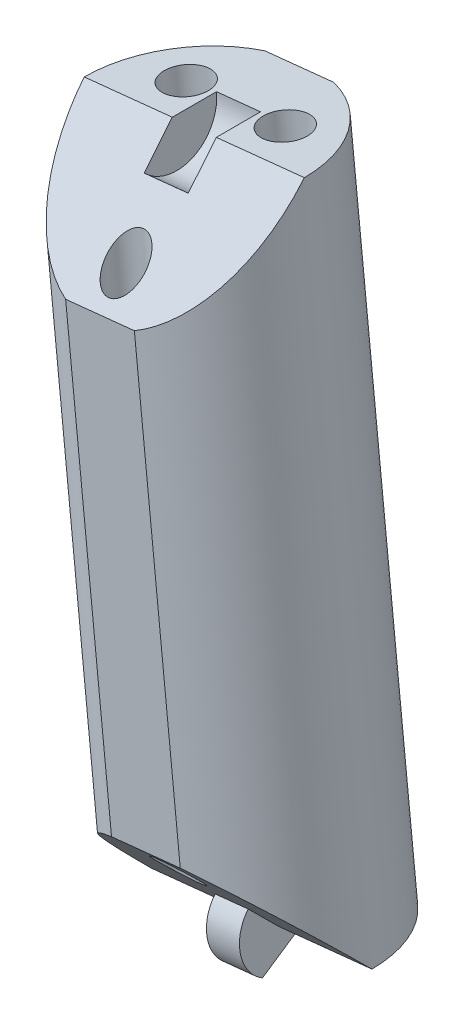
ISO-10303-21;
HEADER;
FILE_DESCRIPTION(('STEP AP214'),'2;1');
FILE_NAME('part.step','',(''),(''),'','','');
FILE_SCHEMA(('AUTOMOTIVE_DESIGN { 1 0 10303 214 1 1 1 1 }'));
ENDSEC;
DATA;
#1=APPLICATION_CONTEXT('core data for automotive mechanical design processes');
#2=APPLICATION_PROTOCOL_DEFINITION('international standard','automotive_design',2000,#1);
#3=PRODUCT_CONTEXT('',#1,'mechanical');
#4=PRODUCT('Part','Part','',(#3));
#5=PRODUCT_RELATED_PRODUCT_CATEGORY('part','',(#4));
#6=PRODUCT_DEFINITION_FORMATION('','',#4);
#7=PRODUCT_DEFINITION_CONTEXT('part definition',#1,'design');
#8=PRODUCT_DEFINITION('design','',#6,#7);
#9=PRODUCT_DEFINITION_SHAPE('','',#8);
#10=(LENGTH_UNIT() NAMED_UNIT(*) SI_UNIT(.MILLI.,.METRE.));
#11=(NAMED_UNIT(*) PLANE_ANGLE_UNIT() SI_UNIT($,.RADIAN.));
#12=(NAMED_UNIT(*) SI_UNIT($,.STERADIAN.) SOLID_ANGLE_UNIT());
#13=UNCERTAINTY_MEASURE_WITH_UNIT(LENGTH_MEASURE(1.E-05),#10,'distance_accuracy_value','');
#14=(GEOMETRIC_REPRESENTATION_CONTEXT(3) GLOBAL_UNCERTAINTY_ASSIGNED_CONTEXT((#13)) GLOBAL_UNIT_ASSIGNED_CONTEXT((#10,
#11,#12)) REPRESENTATION_CONTEXT('',''));
#15=CARTESIAN_POINT('',(0.,0.,0.));
#16=DIRECTION('',(0.,0.,1.));
#17=DIRECTION('',(1.,0.,0.));
#18=AXIS2_PLACEMENT_3D('',#15,#16,#17);
#19=CARTESIAN_POINT('',(-5.08262843117258,150.139051081071,0.));
#20=DIRECTION('',(-0.103150523023817,0.994665757729657,0.));
#21=DIRECTION('',(-0.994665757729657,-0.103150523023817,0.));
#22=AXIS2_PLACEMENT_3D('',#19,#20,#21);
#23=CYLINDRICAL_SURFACE('',#22,8.);
#24=CARTESIAN_POINT('',(-5.08262843117258,150.139051081071,0.));
#25=DIRECTION('',(0.103150523023817,-0.994665757729657,0.));
#26=DIRECTION('',(0.994665757729657,0.103150523023817,0.));
#27=AXIS2_PLACEMENT_3D('',#24,#25,#26);
#28=CIRCLE('',#27,8.);
#29=CARTESIAN_POINT('',(-2.59795416473371,150.396721004998,-7.6));
#30=VERTEX_POINT('',#29);
#31=CARTESIAN_POINT('',(2.87469763066468,150.964255265261,0.));
#32=VERTEX_POINT('',#31);
#33=EDGE_CURVE('E156',#30,#32,#28,.T.);
#34=ORIENTED_EDGE('',*,*,#33,.F.);
#35=DIRECTION('',(-0.103150523023817,0.994665757729657,0.));
#36=VECTOR('',#35,1.);
#37=CARTESIAN_POINT('',(-2.59795416473371,150.396721004998,-7.6));
#38=LINE('',#37,#36);
#39=CARTESIAN_POINT('',(-7.48403157112503,197.512467423771,-7.6));
#40=VERTEX_POINT('',#39);
#41=EDGE_CURVE('E11',#30,#40,#38,.T.);
#42=ORIENTED_EDGE('',*,*,#41,.T.);
#43=CARTESIAN_POINT('',(-9.9687058375639,197.254797499844,0.));
#44=DIRECTION('',(0.103150523023817,-0.994665757729657,0.));
#45=DIRECTION('',(0.994665757729657,0.103150523023817,0.));
#46=AXIS2_PLACEMENT_3D('',#43,#44,#45);
#47=CIRCLE('',#46,8.);
#48=CARTESIAN_POINT('',(-2.01137977572664,198.080001684034,0.));
#49=VERTEX_POINT('',#48);
#50=EDGE_CURVE('E148',#40,#49,#47,.T.);
#51=ORIENTED_EDGE('',*,*,#50,.T.);
#52=CARTESIAN_POINT('',(-9.9687058375639,197.254797499844,0.));
#53=DIRECTION('',(0.0729384343130804,-0.7033349023047,-0.707106781186543));
#54=DIRECTION('',(-0.0729384343130795,0.703334902304692,-0.707106781186552));
#55=AXIS2_PLACEMENT_3D('',#52,#53,#54);
#56=ELLIPSE('',#55,11.3137084989847,8.);
#57=CARTESIAN_POINT('',(-6.70008759614404,189.953007665026,7.6));
#58=VERTEX_POINT('',#57);
#59=EDGE_CURVE('E202',#49,#58,#56,.T.);
#60=ORIENTED_EDGE('',*,*,#59,.T.);
#61=DIRECTION('',(-0.103150523023817,0.994665757729657,0.));
#62=VECTOR('',#61,1.);
#63=CARTESIAN_POINT('',(-2.59795416473372,150.396721004998,7.6));
#64=LINE('',#63,#62);
#65=CARTESIAN_POINT('',(-3.38189813971472,157.956180763743,7.6));
#66=VERTEX_POINT('',#65);
#67=EDGE_CURVE('E174',#58,#66,#64,.F.);
#68=ORIENTED_EDGE('',*,*,#67,.T.);
#69=CARTESIAN_POINT('',(-5.08262843117258,150.139051081071,0.));
#70=DIRECTION('',(-0.0729384343130802,0.703334902304699,-0.707106781186544));
#71=DIRECTION('',(-0.0729384343130796,0.703334902304693,0.707106781186551));
#72=AXIS2_PLACEMENT_3D('',#69,#70,#71);
#73=ELLIPSE('',#72,11.3137084989847,8.);
#74=EDGE_CURVE('E207',#66,#32,#73,.T.);
#75=ORIENTED_EDGE('',*,*,#74,.T.);
#76=EDGE_LOOP('',(#34,#42,#51,#60,#68,#75));
#77=FACE_BOUND('',#76,.T.);
#78=ADVANCED_FACE('F39',(#77),#23,.T.);
#79=CARTESIAN_POINT('',(-9.9687058375639,197.254797499844,0.));
#80=DIRECTION('',(0.103150523023817,-0.994665757729657,0.));
#81=DIRECTION('',(0.994665757729657,0.103150523023817,0.));
#82=AXIS2_PLACEMENT_3D('',#79,#80,#81);
#83=PLANE('',#82);
#84=CARTESIAN_POINT('',(-6.38790910973713,197.62613938273,-3.));
#85=DIRECTION('',(0.103150523023817,-0.994665757729657,0.));
#86=DIRECTION('',(0.994665757729657,0.103150523023817,0.));
#87=AXIS2_PLACEMENT_3D('',#84,#85,#86);
#88=CIRCLE('',#87,1.6);
#89=CARTESIAN_POINT('',(-4.79644389736968,197.791180219568,-3.));
#90=VERTEX_POINT('',#89);
#91=EDGE_CURVE('E189',#90,#90,#88,.T.);
#92=ORIENTED_EDGE('',*,*,#91,.T.);
#93=EDGE_LOOP('',(#92));
#94=FACE_BOUND('',#93,.T.);
#95=CARTESIAN_POINT('',(-13.5495025653907,196.883455616958,-3.));
#96=DIRECTION('',(0.103150523023817,-0.994665757729657,0.));
#97=DIRECTION('',(0.994665757729657,0.103150523023817,0.));
#98=AXIS2_PLACEMENT_3D('',#95,#96,#97);
#99=CIRCLE('',#98,1.6);
#100=CARTESIAN_POINT('',(-11.9580373530232,197.048496453796,-3.));
#101=VERTEX_POINT('',#100);
#102=EDGE_CURVE('E184',#101,#101,#99,.T.);
#103=ORIENTED_EDGE('',*,*,#102,.T.);
#104=EDGE_LOOP('',(#103));
#105=FACE_BOUND('',#104,.T.);
#106=ORIENTED_EDGE('',*,*,#50,.F.);
#107=DIRECTION('',(0.994665757729657,0.103150523023816,0.));
#108=VECTOR('',#107,1.);
#109=CARTESIAN_POINT('',(-12.4533801040028,196.997127575917,-7.6));
#110=LINE('',#109,#108);
#111=CARTESIAN_POINT('',(-12.4533801040028,196.997127575917,-7.6));
#112=VERTEX_POINT('',#111);
#113=EDGE_CURVE('E134',#112,#40,#110,.T.);
#114=ORIENTED_EDGE('',*,*,#113,.F.);
#115=CARTESIAN_POINT('',(-17.9260318994012,196.429593315653,0.));
#116=VERTEX_POINT('',#115);
#117=EDGE_CURVE('E146',#116,#112,#47,.T.);
#118=ORIENTED_EDGE('',*,*,#117,.F.);
#119=DIRECTION('',(0.994665757729657,0.103150523023817,0.));
#120=VECTOR('',#119,1.);
#121=CARTESIAN_POINT('',(-9.9687058375639,197.254797499844,0.));
#122=LINE('',#121,#120);
#123=CARTESIAN_POINT('',(-11.5601710499314,197.089756663006,0.));
#124=VERTEX_POINT('',#123);
#125=EDGE_CURVE('E165',#116,#124,#122,.T.);
#126=ORIENTED_EDGE('',*,*,#125,.T.);
#127=DIRECTION('',(0.,0.,-1.));
#128=VECTOR('',#127,1.);
#129=CARTESIAN_POINT('',(-11.5601710499314,197.089756663006,0.));
#130=LINE('',#129,#128);
#131=CARTESIAN_POINT('',(-11.5601710499314,197.089756663006,-3.2));
#132=VERTEX_POINT('',#131);
#133=EDGE_CURVE('E256',#124,#132,#130,.T.);
#134=ORIENTED_EDGE('',*,*,#133,.T.);
#135=DIRECTION('',(-0.994665757729657,-0.103150523023817,0.));
#136=VECTOR('',#135,1.);
#137=CARTESIAN_POINT('',(-8.37724062519646,197.419838336682,-3.2));
#138=LINE('',#137,#136);
#139=CARTESIAN_POINT('',(-8.37724062519646,197.419838336682,-3.2));
#140=VERTEX_POINT('',#139);
#141=EDGE_CURVE('E269',#140,#132,#138,.T.);
#142=ORIENTED_EDGE('',*,*,#141,.F.);
#143=DIRECTION('',(0.,0.,-1.));
#144=VECTOR('',#143,1.);
#145=CARTESIAN_POINT('',(-8.37724062519647,197.419838336682,0.));
#146=LINE('',#145,#144);
#147=CARTESIAN_POINT('',(-8.37724062519647,197.419838336682,0.));
#148=VERTEX_POINT('',#147);
#149=EDGE_CURVE('E257',#148,#140,#146,.T.);
#150=ORIENTED_EDGE('',*,*,#149,.F.);
#151=EDGE_CURVE('E169',#148,#49,#122,.T.);
#152=ORIENTED_EDGE('',*,*,#151,.T.);
#153=EDGE_LOOP('',(#106,#114,#118,#126,#134,#142,#150,#152));
#154=FACE_BOUND('',#153,.T.);
#155=ADVANCED_FACE('F144',(#94,#105,#154),#83,.F.);
#156=CARTESIAN_POINT('',(2.8227096185235,198.581314658253,0.));
#157=DIRECTION('',(0.0729384343130804,-0.7033349023047,-0.707106781186543));
#158=DIRECTION('',(0.,0.708995228875744,-0.705213276556412));
#159=AXIS2_PLACEMENT_3D('',#156,#157,#158);
#160=PLANE('',#159);
#161=CARTESIAN_POINT('',(-9.40137796093292,191.784135832331,5.5));
#162=DIRECTION('',(0.0729384343130804,-0.7033349023047,-0.707106781186543));
#163=DIRECTION('',(-0.0729384343130795,0.703334902304692,-0.707106781186552));
#164=AXIS2_PLACEMENT_3D('',#161,#162,#163);
#165=ELLIPSE('',#164,1.97989898732232,1.4);
#166=CARTESIAN_POINT('',(-9.54578869316626,193.176667893152,4.1));
#167=VERTEX_POINT('',#166);
#168=EDGE_CURVE('E179',#167,#167,#165,.T.);
#169=ORIENTED_EDGE('',*,*,#168,.T.);
#170=EDGE_LOOP('',(#169));
#171=FACE_BOUND('',#170,.T.);
#172=CARTESIAN_POINT('',(-11.6694361290218,189.437667817172,7.6));
#173=VERTEX_POINT('',#172);
#174=EDGE_CURVE('E153',#173,#116,#56,.T.);
#175=ORIENTED_EDGE('',*,*,#174,.F.);
#176=DIRECTION('',(0.994665757729657,0.103150523023817,0.));
#177=VECTOR('',#176,1.);
#178=CARTESIAN_POINT('',(3.6066535935045,191.021854899508,7.6));
#179=LINE('',#178,#177);
#180=EDGE_CURVE('E198',#173,#58,#179,.T.);
#181=ORIENTED_EDGE('',*,*,#180,.T.);
#182=ORIENTED_EDGE('',*,*,#59,.F.);
#183=ORIENTED_EDGE('',*,*,#151,.F.);
#184=DIRECTION('',(-0.0729384343130776,0.703334902304677,-0.707106781186567));
#185=VECTOR('',#184,1.);
#186=CARTESIAN_POINT('',(-8.14383763539462,195.169166649307,2.26274169979702));
#187=LINE('',#186,#185);
#188=CARTESIAN_POINT('',(-8.14383763539462,195.169166649307,2.26274169979702));
#189=VERTEX_POINT('',#188);
#190=EDGE_CURVE('E266',#189,#148,#187,.T.);
#191=ORIENTED_EDGE('',*,*,#190,.F.);
#192=DIRECTION('',(-0.994665757729657,-0.103150523023817,0.));
#193=VECTOR('',#192,1.);
#194=CARTESIAN_POINT('',(-8.14383763539462,195.169166649307,2.26274169979702));
#195=LINE('',#194,#193);
#196=CARTESIAN_POINT('',(-11.3267680601295,194.839084975631,2.26274169979702));
#197=VERTEX_POINT('',#196);
#198=EDGE_CURVE('E278',#189,#197,#195,.T.);
#199=ORIENTED_EDGE('',*,*,#198,.T.);
#200=DIRECTION('',(-0.0729384343130776,0.703334902304677,-0.707106781186567));
#201=VECTOR('',#200,1.);
#202=CARTESIAN_POINT('',(-11.3267680601295,194.839084975631,2.26274169979702));
#203=LINE('',#202,#201);
#204=EDGE_CURVE('E262',#197,#124,#203,.T.);
#205=ORIENTED_EDGE('',*,*,#204,.T.);
#206=ORIENTED_EDGE('',*,*,#125,.F.);
#207=EDGE_LOOP('',(#175,#181,#182,#183,#191,#199,#205,#206));
#208=FACE_BOUND('',#207,.T.);
#209=ADVANCED_FACE('F196',(#171,#208),#160,.F.);
#210=CARTESIAN_POINT('',(-5.08262843117258,150.139051081071,0.));
#211=DIRECTION('',(0.103150523023817,-0.994665757729657,0.));
#212=DIRECTION('',(0.994665757729657,0.103150523023817,0.));
#213=AXIS2_PLACEMENT_3D('',#210,#211,#212);
#214=PLANE('',#213);
#215=DIRECTION('',(-0.994665757729657,-0.103150523023817,0.));
#216=VECTOR('',#215,1.);
#217=CARTESIAN_POINT('',(-5.08262843117258,150.139051081071,-7.6));
#218=LINE('',#217,#216);
#219=CARTESIAN_POINT('',(-7.56730269761144,149.881381157144,-7.6));
#220=VERTEX_POINT('',#219);
#221=EDGE_CURVE('E55',#30,#220,#218,.T.);
#222=ORIENTED_EDGE('',*,*,#221,.F.);
#223=ORIENTED_EDGE('',*,*,#33,.T.);
#224=DIRECTION('',(0.994665757729657,0.103150523023817,0.));
#225=VECTOR('',#224,1.);
#226=CARTESIAN_POINT('',(-5.08262843117258,150.139051081071,0.));
#227=LINE('',#226,#225);
#228=CARTESIAN_POINT('',(-3.889029521897,150.262831708699,0.));
#229=VERTEX_POINT('',#228);
#230=EDGE_CURVE('E168',#229,#32,#227,.T.);
#231=ORIENTED_EDGE('',*,*,#230,.F.);
#232=DIRECTION('',(0.,0.,-1.));
#233=VECTOR('',#232,1.);
#234=CARTESIAN_POINT('',(-3.889029521897,150.262831708699,0.));
#235=LINE('',#234,#233);
#236=CARTESIAN_POINT('',(-3.889029521897,150.262831708699,-2.8));
#237=VERTEX_POINT('',#236);
#238=EDGE_CURVE('E282',#229,#237,#235,.T.);
#239=ORIENTED_EDGE('',*,*,#238,.T.);
#240=DIRECTION('',(0.994665757729657,0.103150523023817,0.));
#241=VECTOR('',#240,1.);
#242=CARTESIAN_POINT('',(-6.27622734044818,150.015270453442,-2.8));
#243=LINE('',#242,#241);
#244=CARTESIAN_POINT('',(-6.27622734044818,150.015270453442,-2.8));
#245=VERTEX_POINT('',#244);
#246=EDGE_CURVE('E203',#245,#237,#243,.T.);
#247=ORIENTED_EDGE('',*,*,#246,.F.);
#248=DIRECTION('',(0.,0.,-1.));
#249=VECTOR('',#248,1.);
#250=CARTESIAN_POINT('',(-6.27622734044818,150.015270453442,0.));
#251=LINE('',#250,#249);
#252=CARTESIAN_POINT('',(-6.27622734044818,150.015270453442,0.));
#253=VERTEX_POINT('',#252);
#254=EDGE_CURVE('E237',#253,#245,#251,.T.);
#255=ORIENTED_EDGE('',*,*,#254,.F.);
#256=CARTESIAN_POINT('',(-13.0399544930098,149.31384689688,0.));
#257=VERTEX_POINT('',#256);
#258=EDGE_CURVE('E170',#257,#253,#227,.T.);
#259=ORIENTED_EDGE('',*,*,#258,.F.);
#260=EDGE_CURVE('E160',#257,#220,#28,.T.);
#261=ORIENTED_EDGE('',*,*,#260,.T.);
#262=EDGE_LOOP('',(#222,#223,#231,#239,#247,#255,#259,#261));
#263=FACE_BOUND('',#262,.T.);
#264=CARTESIAN_POINT('',(-1.50183170334581,150.510392963956,-3.));
#265=DIRECTION('',(0.103150523023817,-0.994665757729657,0.));
#266=DIRECTION('',(0.994665757729657,0.103150523023817,0.));
#267=AXIS2_PLACEMENT_3D('',#264,#265,#266);
#268=CIRCLE('',#267,1.6);
#269=CARTESIAN_POINT('',(0.0896335090216423,150.675433800795,-3.));
#270=VERTEX_POINT('',#269);
#271=EDGE_CURVE('E185',#270,#270,#268,.T.);
#272=ORIENTED_EDGE('',*,*,#271,.F.);
#273=EDGE_LOOP('',(#272));
#274=FACE_BOUND('',#273,.T.);
#275=CARTESIAN_POINT('',(-8.66342515899934,149.767709198185,-3.));
#276=DIRECTION('',(0.103150523023817,-0.994665757729657,0.));
#277=DIRECTION('',(0.994665757729657,0.103150523023817,0.));
#278=AXIS2_PLACEMENT_3D('',#275,#276,#277);
#279=CIRCLE('',#278,1.6);
#280=CARTESIAN_POINT('',(-7.07195994663189,149.932750035023,-3.));
#281=VERTEX_POINT('',#280);
#282=EDGE_CURVE('E180',#281,#281,#279,.T.);
#283=ORIENTED_EDGE('',*,*,#282,.F.);
#284=EDGE_LOOP('',(#283));
#285=FACE_BOUND('',#284,.T.);
#286=ADVANCED_FACE('F232',(#263,#274,#285),#214,.T.);
#287=CARTESIAN_POINT('',(7.70878702491482,151.46556823948,0.));
#288=DIRECTION('',(-0.0729384343130802,0.703334902304699,-0.707106781186544));
#289=DIRECTION('',(0.,0.708995228875745,0.705213276556411));
#290=AXIS2_PLACEMENT_3D('',#287,#288,#289);
#291=PLANE('',#290);
#292=CARTESIAN_POINT('',(-5.64995630780356,155.609712748584,5.5));
#293=DIRECTION('',(-0.0729384343130802,0.703334902304699,-0.707106781186544));
#294=DIRECTION('',(-0.0729384343130796,0.703334902304693,0.707106781186551));
#295=AXIS2_PLACEMENT_3D('',#292,#293,#294);
#296=ELLIPSE('',#295,1.97989898732232,1.4);
#297=CARTESIAN_POINT('',(-5.7943670400369,157.002244809405,6.9));
#298=VERTEX_POINT('',#297);
#299=EDGE_CURVE('E175',#298,#298,#296,.T.);
#300=ORIENTED_EDGE('',*,*,#299,.T.);
#301=EDGE_LOOP('',(#300));
#302=FACE_BOUND('',#301,.T.);
#303=ORIENTED_EDGE('',*,*,#74,.F.);
#304=DIRECTION('',(-0.994665757729657,-0.103150523023817,0.));
#305=VECTOR('',#304,1.);
#306=CARTESIAN_POINT('',(6.92484304993382,159.025027998225,7.6));
#307=LINE('',#306,#305);
#308=CARTESIAN_POINT('',(-8.35124667259244,157.440840915889,7.6));
#309=VERTEX_POINT('',#308);
#310=EDGE_CURVE('E63',#66,#309,#307,.T.);
#311=ORIENTED_EDGE('',*,*,#310,.T.);
#312=EDGE_CURVE('E162',#257,#309,#73,.T.);
#313=ORIENTED_EDGE('',*,*,#312,.F.);
#314=ORIENTED_EDGE('',*,*,#258,.T.);
#315=DIRECTION('',(0.0729384343130802,-0.7033349023047,-0.707106781186544));
#316=VECTOR('',#315,1.);
#317=CARTESIAN_POINT('',(-6.4804549565248,151.984608179895,1.97989898732233));
#318=LINE('',#317,#316);
#319=CARTESIAN_POINT('',(-6.4804549565248,151.984608179895,1.97989898732233));
#320=VERTEX_POINT('',#319);
#321=EDGE_CURVE('E239',#320,#253,#318,.T.);
#322=ORIENTED_EDGE('',*,*,#321,.F.);
#323=DIRECTION('',(0.994665757729657,0.103150523023817,0.));
#324=VECTOR('',#323,1.);
#325=CARTESIAN_POINT('',(-6.4804549565248,151.984608179895,1.97989898732233));
#326=LINE('',#325,#324);
#327=CARTESIAN_POINT('',(-4.09325713797362,152.232169435152,1.97989898732233));
#328=VERTEX_POINT('',#327);
#329=EDGE_CURVE('E295',#320,#328,#326,.T.);
#330=ORIENTED_EDGE('',*,*,#329,.T.);
#331=DIRECTION('',(0.0729384343130802,-0.7033349023047,-0.707106781186544));
#332=VECTOR('',#331,1.);
#333=CARTESIAN_POINT('',(-4.09325713797362,152.232169435152,1.97989898732233));
#334=LINE('',#333,#332);
#335=EDGE_CURVE('E225',#328,#229,#334,.T.);
#336=ORIENTED_EDGE('',*,*,#335,.T.);
#337=ORIENTED_EDGE('',*,*,#230,.T.);
#338=EDGE_LOOP('',(#303,#311,#313,#314,#322,#330,#336,#337));
#339=FACE_BOUND('',#338,.T.);
#340=ADVANCED_FACE('F222',(#302,#339),#291,.F.);
#341=ORIENTED_EDGE('',*,*,#117,.T.);
#342=DIRECTION('',(-0.103150523023817,0.994665757729657,0.));
#343=VECTOR('',#342,1.);
#344=CARTESIAN_POINT('',(-7.56730269761144,149.881381157144,-7.6));
#345=LINE('',#344,#343);
#346=EDGE_CURVE('E48',#112,#220,#345,.F.);
#347=ORIENTED_EDGE('',*,*,#346,.T.);
#348=ORIENTED_EDGE('',*,*,#260,.F.);
#349=ORIENTED_EDGE('',*,*,#312,.T.);
#350=DIRECTION('',(-0.103150523023817,0.994665757729657,0.));
#351=VECTOR('',#350,1.);
#352=CARTESIAN_POINT('',(-7.56730269761143,149.881381157144,7.6));
#353=LINE('',#352,#351);
#354=EDGE_CURVE('E140',#309,#173,#353,.T.);
#355=ORIENTED_EDGE('',*,*,#354,.T.);
#356=ORIENTED_EDGE('',*,*,#174,.T.);
#357=EDGE_LOOP('',(#341,#347,#348,#349,#355,#356));
#358=FACE_BOUND('',#357,.T.);
#359=ADVANCED_FACE('F41',(#358),#23,.T.);
#360=CARTESIAN_POINT('',(-6.27622734044818,150.015270453442,-2.8));
#361=DIRECTION('',(-0.0893309733522772,0.861405814468384,0.499999999999995));
#362=DIRECTION('',(0.,-0.502007025803858,0.864863541862856));
#363=AXIS2_PLACEMENT_3D('',#360,#361,#362);
#364=PLANE('',#363);
#365=DIRECTION('',(0.0515752615119079,-0.497332878864824,0.866025403784442));
#366=VECTOR('',#365,1.);
#367=CARTESIAN_POINT('',(-3.889029521897,150.262831708699,-2.8));
#368=LINE('',#367,#366);
#369=CARTESIAN_POINT('',(-3.63890279651063,147.850895428188,1.40000000000003));
#370=VERTEX_POINT('',#369);
#371=EDGE_CURVE('E298',#237,#370,#368,.T.);
#372=ORIENTED_EDGE('',*,*,#371,.T.);
#373=DIRECTION('',(0.994665757729657,0.103150523023817,0.));
#374=VECTOR('',#373,1.);
#375=CARTESIAN_POINT('',(-6.0261006150618,147.603334172931,1.40000000000003));
#376=LINE('',#375,#374);
#377=CARTESIAN_POINT('',(-6.0261006150618,147.603334172931,1.40000000000003));
#378=VERTEX_POINT('',#377);
#379=EDGE_CURVE('E209',#378,#370,#376,.T.);
#380=ORIENTED_EDGE('',*,*,#379,.F.);
#381=DIRECTION('',(0.0515752615119079,-0.497332878864824,0.866025403784442));
#382=VECTOR('',#381,1.);
#383=CARTESIAN_POINT('',(-6.27622734044818,150.015270453442,-2.8));
#384=LINE('',#383,#382);
#385=EDGE_CURVE('E287',#245,#378,#384,.T.);
#386=ORIENTED_EDGE('',*,*,#385,.F.);
#387=ORIENTED_EDGE('',*,*,#246,.T.);
#388=EDGE_LOOP('',(#372,#380,#386,#387));
#389=FACE_BOUND('',#388,.T.);
#390=ADVANCED_FACE('F318',(#389),#364,.F.);
#391=CARTESIAN_POINT('',(-6.27622734044818,150.015270453442,0.));
#392=DIRECTION('',(0.994665757729657,0.103150523023817,0.));
#393=DIRECTION('',(-0.103150523023817,0.994665757729657,0.));
#394=AXIS2_PLACEMENT_3D('',#391,#392,#393);
#395=CYLINDRICAL_SURFACE('',#394,2.8);
#396=CARTESIAN_POINT('',(-3.889029521897,150.262831708699,0.));
#397=DIRECTION('',(-0.994665757729657,-0.103150523023817,0.));
#398=DIRECTION('',(-0.103150523023817,0.994665757729657,0.));
#399=AXIS2_PLACEMENT_3D('',#396,#397,#398);
#400=CIRCLE('',#399,2.8);
#401=EDGE_CURVE('E301',#370,#328,#400,.T.);
#402=ORIENTED_EDGE('',*,*,#401,.T.);
#403=ORIENTED_EDGE('',*,*,#329,.F.);
#404=CARTESIAN_POINT('',(-6.27622734044818,150.015270453442,0.));
#405=DIRECTION('',(-0.994665757729657,-0.103150523023817,0.));
#406=DIRECTION('',(-0.103150523023817,0.994665757729657,0.));
#407=AXIS2_PLACEMENT_3D('',#404,#405,#406);
#408=CIRCLE('',#407,2.8);
#409=EDGE_CURVE('E290',#378,#320,#408,.T.);
#410=ORIENTED_EDGE('',*,*,#409,.F.);
#411=ORIENTED_EDGE('',*,*,#379,.T.);
#412=EDGE_LOOP('',(#402,#403,#410,#411));
#413=FACE_BOUND('',#412,.T.);
#414=ADVANCED_FACE('F313',(#413),#395,.T.);
#415=CARTESIAN_POINT('',(-6.27622734044818,150.015270453442,0.));
#416=DIRECTION('',(0.994665757729657,0.103150523023817,0.));
#417=DIRECTION('',(-0.103150523023817,0.994665757729657,0.));
#418=AXIS2_PLACEMENT_3D('',#415,#416,#417);
#419=PLANE('',#418);
#420=ORIENTED_EDGE('',*,*,#254,.T.);
#421=ORIENTED_EDGE('',*,*,#385,.T.);
#422=ORIENTED_EDGE('',*,*,#409,.T.);
#423=ORIENTED_EDGE('',*,*,#321,.T.);
#424=EDGE_LOOP('',(#420,#421,#422,#423));
#425=FACE_BOUND('',#424,.T.);
#426=ADVANCED_FACE('F320',(#425),#419,.F.);
#427=CARTESIAN_POINT('',(-3.889029521897,150.262831708699,0.));
#428=DIRECTION('',(0.994665757729657,0.103150523023817,0.));
#429=DIRECTION('',(-0.103150523023817,0.994665757729657,0.));
#430=AXIS2_PLACEMENT_3D('',#427,#428,#429);
#431=PLANE('',#430);
#432=ORIENTED_EDGE('',*,*,#238,.F.);
#433=ORIENTED_EDGE('',*,*,#335,.F.);
#434=ORIENTED_EDGE('',*,*,#401,.F.);
#435=ORIENTED_EDGE('',*,*,#371,.F.);
#436=EDGE_LOOP('',(#432,#433,#434,#435));
#437=FACE_BOUND('',#436,.T.);
#438=ADVANCED_FACE('F317',(#437),#431,.T.);
#439=CARTESIAN_POINT('',(-8.37724062519647,197.419838336682,0.));
#440=DIRECTION('',(-0.994665757729657,-0.103150523023817,0.));
#441=DIRECTION('',(0.103150523023817,-0.994665757729657,0.));
#442=AXIS2_PLACEMENT_3D('',#439,#440,#441);
#443=CYLINDRICAL_SURFACE('',#442,3.2);
#444=CARTESIAN_POINT('',(-11.5601710499314,197.089756663006,0.));
#445=DIRECTION('',(-0.994665757729657,-0.103150523023817,0.));
#446=DIRECTION('',(0.103150523023817,-0.994665757729657,0.));
#447=AXIS2_PLACEMENT_3D('',#444,#445,#446);
#448=CIRCLE('',#447,3.2);
#449=EDGE_CURVE('E273',#132,#197,#448,.T.);
#450=ORIENTED_EDGE('',*,*,#449,.T.);
#451=ORIENTED_EDGE('',*,*,#198,.F.);
#452=CARTESIAN_POINT('',(-8.37724062519647,197.419838336682,0.));
#453=DIRECTION('',(-0.994665757729657,-0.103150523023817,0.));
#454=DIRECTION('',(0.103150523023817,-0.994665757729657,0.));
#455=AXIS2_PLACEMENT_3D('',#452,#453,#454);
#456=CIRCLE('',#455,3.2);
#457=EDGE_CURVE('E261',#140,#189,#456,.T.);
#458=ORIENTED_EDGE('',*,*,#457,.F.);
#459=ORIENTED_EDGE('',*,*,#141,.T.);
#460=EDGE_LOOP('',(#450,#451,#458,#459));
#461=FACE_BOUND('',#460,.T.);
#462=ADVANCED_FACE('F327',(#461),#443,.F.);
#463=CARTESIAN_POINT('',(-8.37724062519647,197.419838336682,0.));
#464=DIRECTION('',(-0.994665757729657,-0.103150523023817,0.));
#465=DIRECTION('',(0.103150523023817,-0.994665757729657,0.));
#466=AXIS2_PLACEMENT_3D('',#463,#464,#465);
#467=PLANE('',#466);
#468=ORIENTED_EDGE('',*,*,#149,.T.);
#469=ORIENTED_EDGE('',*,*,#457,.T.);
#470=ORIENTED_EDGE('',*,*,#190,.T.);
#471=EDGE_LOOP('',(#468,#469,#470));
#472=FACE_BOUND('',#471,.T.);
#473=ADVANCED_FACE('F368',(#472),#467,.T.);
#474=CARTESIAN_POINT('',(-11.5601710499314,197.089756663006,0.));
#475=DIRECTION('',(-0.994665757729657,-0.103150523023817,0.));
#476=DIRECTION('',(0.103150523023817,-0.994665757729657,0.));
#477=AXIS2_PLACEMENT_3D('',#474,#475,#476);
#478=PLANE('',#477);
#479=ORIENTED_EDGE('',*,*,#133,.F.);
#480=ORIENTED_EDGE('',*,*,#204,.F.);
#481=ORIENTED_EDGE('',*,*,#449,.F.);
#482=EDGE_LOOP('',(#479,#480,#481));
#483=FACE_BOUND('',#482,.T.);
#484=ADVANCED_FACE('F358',(#483),#478,.F.);
#485=CARTESIAN_POINT('',(-4.73779694186663,146.813890291335,5.5));
#486=DIRECTION('',(-0.103150523023817,0.994665757729657,0.));
#487=DIRECTION('',(-0.994665757729657,-0.103150523023817,0.));
#488=AXIS2_PLACEMENT_3D('',#485,#486,#487);
#489=CYLINDRICAL_SURFACE('',#488,1.4);
#490=ORIENTED_EDGE('',*,*,#299,.F.);
#491=EDGE_LOOP('',(#490));
#492=FACE_BOUND('',#491,.T.);
#493=ORIENTED_EDGE('',*,*,#168,.F.);
#494=EDGE_LOOP('',(#493));
#495=FACE_BOUND('',#494,.T.);
#496=ADVANCED_FACE('F355',(#492,#495),#489,.F.);
#497=CARTESIAN_POINT('',(-8.3185936696934,146.442548408449,-3.));
#498=DIRECTION('',(-0.103150523023817,0.994665757729657,0.));
#499=DIRECTION('',(-0.994665757729657,-0.103150523023817,0.));
#500=AXIS2_PLACEMENT_3D('',#497,#498,#499);
#501=CYLINDRICAL_SURFACE('',#500,1.6);
#502=ORIENTED_EDGE('',*,*,#282,.T.);
#503=EDGE_LOOP('',(#502));
#504=FACE_BOUND('',#503,.T.);
#505=ORIENTED_EDGE('',*,*,#102,.F.);
#506=EDGE_LOOP('',(#505));
#507=FACE_BOUND('',#506,.T.);
#508=ADVANCED_FACE('F357',(#504,#507),#501,.F.);
#509=CARTESIAN_POINT('',(-1.15700021403987,147.185232174221,-3.));
#510=DIRECTION('',(-0.103150523023817,0.994665757729657,0.));
#511=DIRECTION('',(-0.994665757729657,-0.103150523023817,0.));
#512=AXIS2_PLACEMENT_3D('',#509,#510,#511);
#513=CYLINDRICAL_SURFACE('',#512,1.6);
#514=ORIENTED_EDGE('',*,*,#271,.T.);
#515=EDGE_LOOP('',(#514));
#516=FACE_BOUND('',#515,.T.);
#517=ORIENTED_EDGE('',*,*,#91,.F.);
#518=EDGE_LOOP('',(#517));
#519=FACE_BOUND('',#518,.T.);
#520=ADVANCED_FACE('F365',(#516,#519),#513,.F.);
#521=CARTESIAN_POINT('',(-7.2224712083055,146.556220367408,7.6));
#522=DIRECTION('',(0.,0.,-1.));
#523=DIRECTION('',(-1.,0.,0.));
#524=AXIS2_PLACEMENT_3D('',#521,#522,#523);
#525=PLANE('',#524);
#526=ORIENTED_EDGE('',*,*,#354,.F.);
#527=ORIENTED_EDGE('',*,*,#310,.F.);
#528=ORIENTED_EDGE('',*,*,#67,.F.);
#529=ORIENTED_EDGE('',*,*,#180,.F.);
#530=EDGE_LOOP('',(#526,#527,#528,#529));
#531=FACE_BOUND('',#530,.T.);
#532=ADVANCED_FACE('F374',(#531),#525,.F.);
#533=CARTESIAN_POINT('',(-7.2224712083055,146.556220367408,-7.6));
#534=DIRECTION('',(0.,0.,1.));
#535=DIRECTION('',(1.,0.,0.));
#536=AXIS2_PLACEMENT_3D('',#533,#534,#535);
#537=PLANE('',#536);
#538=ORIENTED_EDGE('',*,*,#221,.T.);
#539=ORIENTED_EDGE('',*,*,#346,.F.);
#540=ORIENTED_EDGE('',*,*,#113,.T.);
#541=ORIENTED_EDGE('',*,*,#41,.F.);
#542=EDGE_LOOP('',(#538,#539,#540,#541));
#543=FACE_BOUND('',#542,.T.);
#544=ADVANCED_FACE('F133',(#543),#537,.F.);
#545=CLOSED_SHELL('',(#78,#155,#209,#286,#340,#359,#390,#414,#426,#438,#462,#473,#484,#496,#508,
#520,#532,#544));
#546=MANIFOLD_SOLID_BREP('B2',#545);
#547=ADVANCED_BREP_SHAPE_REPRESENTATION('',(#18,#546),#14);
#548=SHAPE_DEFINITION_REPRESENTATION(#9,#547);
ENDSEC;
END-ISO-10303-21;
